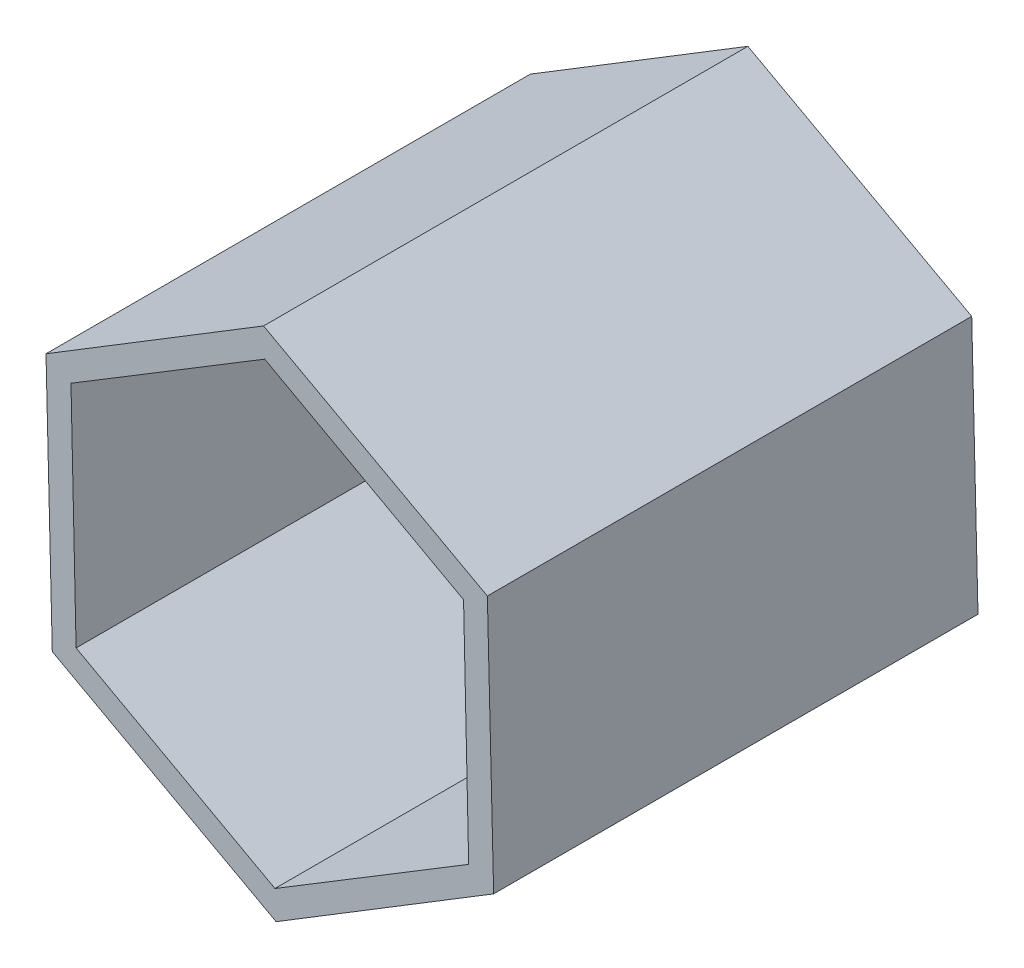
ISO-10303-21;
HEADER;
FILE_DESCRIPTION(('STEP AP214'),'2;1');
FILE_NAME('part.step','',(''),(''),'','','');
FILE_SCHEMA(('AUTOMOTIVE_DESIGN { 1 0 10303 214 1 1 1 1 }'));
ENDSEC;
DATA;
#1=APPLICATION_CONTEXT('core data for automotive mechanical design processes');
#2=APPLICATION_PROTOCOL_DEFINITION('international standard','automotive_design',2000,#1);
#3=PRODUCT_CONTEXT('',#1,'mechanical');
#4=PRODUCT('Part','Part','',(#3));
#5=PRODUCT_RELATED_PRODUCT_CATEGORY('part','',(#4));
#6=PRODUCT_DEFINITION_FORMATION('','',#4);
#7=PRODUCT_DEFINITION_CONTEXT('part definition',#1,'design');
#8=PRODUCT_DEFINITION('design','',#6,#7);
#9=PRODUCT_DEFINITION_SHAPE('','',#8);
#10=(LENGTH_UNIT() NAMED_UNIT(*) SI_UNIT(.MILLI.,.METRE.));
#11=(NAMED_UNIT(*) PLANE_ANGLE_UNIT() SI_UNIT($,.RADIAN.));
#12=(NAMED_UNIT(*) SI_UNIT($,.STERADIAN.) SOLID_ANGLE_UNIT());
#13=UNCERTAINTY_MEASURE_WITH_UNIT(LENGTH_MEASURE(1.E-05),#10,'distance_accuracy_value','');
#14=(GEOMETRIC_REPRESENTATION_CONTEXT(3) GLOBAL_UNCERTAINTY_ASSIGNED_CONTEXT((#13)) GLOBAL_UNIT_ASSIGNED_CONTEXT((#10,
#11,#12)) REPRESENTATION_CONTEXT('',''));
#15=CARTESIAN_POINT('',(0.,0.,0.));
#16=DIRECTION('',(0.,0.,1.));
#17=DIRECTION('',(1.,0.,0.));
#18=AXIS2_PLACEMENT_3D('',#15,#16,#17);
#19=CARTESIAN_POINT('',(58.6900866331029,-31.9809873450362,127.));
#20=DIRECTION('',(-0.999695721622004,-0.0246670665191707,0.));
#21=DIRECTION('',(0.0246670665191707,-0.999695721622004,0.));
#22=AXIS2_PLACEMENT_3D('',#19,#20,#21);
#23=PLANE('',#22);
#24=DIRECTION('',(-0.0246670665191707,0.999695721622004,0.));
#25=VECTOR('',#24,1.);
#26=CARTESIAN_POINT('',(58.6900866331029,-31.9809873450362,0.));
#27=LINE('',#26,#25);
#28=CARTESIAN_POINT('',(58.6900866331029,-31.9809873450362,0.));
#29=VERTEX_POINT('',#28);
#30=CARTESIAN_POINT('',(57.0413907954614,34.8366123020586,0.));
#31=VERTEX_POINT('',#30);
#32=EDGE_CURVE('E166',#29,#31,#27,.T.);
#33=ORIENTED_EDGE('',*,*,#32,.T.);
#34=DIRECTION('',(0.,0.,-1.));
#35=VECTOR('',#34,1.);
#36=CARTESIAN_POINT('',(57.0413907954614,34.8366123020586,127.));
#37=LINE('',#36,#35);
#38=CARTESIAN_POINT('',(57.0413907954614,34.8366123020586,127.));
#39=VERTEX_POINT('',#38);
#40=EDGE_CURVE('E11',#39,#31,#37,.T.);
#41=ORIENTED_EDGE('',*,*,#40,.F.);
#42=DIRECTION('',(-0.0246670665191707,0.999695721622004,0.));
#43=VECTOR('',#42,1.);
#44=CARTESIAN_POINT('',(58.6900866331029,-31.9809873450362,127.));
#45=LINE('',#44,#43);
#46=CARTESIAN_POINT('',(58.6900866331029,-31.9809873450362,127.));
#47=VERTEX_POINT('',#46);
#48=EDGE_CURVE('E174',#47,#39,#45,.T.);
#49=ORIENTED_EDGE('',*,*,#48,.F.);
#50=DIRECTION('',(0.,0.,-1.));
#51=VECTOR('',#50,1.);
#52=CARTESIAN_POINT('',(58.6900866331029,-31.9809873450362,127.));
#53=LINE('',#52,#51);
#54=EDGE_CURVE('E188',#47,#29,#53,.T.);
#55=ORIENTED_EDGE('',*,*,#54,.T.);
#56=EDGE_LOOP('',(#33,#41,#49,#55));
#57=FACE_BOUND('',#56,.T.);
#58=ADVANCED_FACE('F33',(#57),#23,.F.);
#59=CARTESIAN_POINT('',(57.0413907954614,34.8366123020586,127.));
#60=DIRECTION('',(-0.478485554568559,-0.878095424238857,0.));
#61=DIRECTION('',(0.878095424238857,-0.478485554568559,0.));
#62=AXIS2_PLACEMENT_3D('',#59,#60,#61);
#63=PLANE('',#62);
#64=DIRECTION('',(-0.878095424238857,0.478485554568559,0.));
#65=VECTOR('',#64,1.);
#66=CARTESIAN_POINT('',(57.0413907954614,34.8366123020586,0.));
#67=LINE('',#66,#65);
#68=CARTESIAN_POINT('',(-1.64869583764149,66.8175996470947,0.));
#69=VERTEX_POINT('',#68);
#70=EDGE_CURVE('E191',#31,#69,#67,.T.);
#71=ORIENTED_EDGE('',*,*,#70,.T.);
#72=DIRECTION('',(0.,0.,-1.));
#73=VECTOR('',#72,1.);
#74=CARTESIAN_POINT('',(-1.64869583764149,66.8175996470947,127.));
#75=LINE('',#74,#73);
#76=CARTESIAN_POINT('',(-1.64869583764149,66.8175996470947,127.));
#77=VERTEX_POINT('',#76);
#78=EDGE_CURVE('E40',#77,#69,#75,.T.);
#79=ORIENTED_EDGE('',*,*,#78,.F.);
#80=DIRECTION('',(-0.878095424238857,0.478485554568559,0.));
#81=VECTOR('',#80,1.);
#82=CARTESIAN_POINT('',(57.0413907954614,34.8366123020586,127.));
#83=LINE('',#82,#81);
#84=EDGE_CURVE('E177',#39,#77,#83,.T.);
#85=ORIENTED_EDGE('',*,*,#84,.F.);
#86=ORIENTED_EDGE('',*,*,#40,.T.);
#87=EDGE_LOOP('',(#71,#79,#85,#86));
#88=FACE_BOUND('',#87,.T.);
#89=ADVANCED_FACE('F236',(#88),#63,.F.);
#90=CARTESIAN_POINT('',(-1.64869583764149,66.8175996470947,127.));
#91=DIRECTION('',(0.521210167053444,-0.853428357719686,0.));
#92=DIRECTION('',(0.853428357719686,0.521210167053444,0.));
#93=AXIS2_PLACEMENT_3D('',#90,#91,#92);
#94=PLANE('',#93);
#95=DIRECTION('',(-0.853428357719686,-0.521210167053444,0.));
#96=VECTOR('',#95,1.);
#97=CARTESIAN_POINT('',(-1.64869583764149,66.8175996470947,0.));
#98=LINE('',#97,#96);
#99=CARTESIAN_POINT('',(-58.6900866331029,31.9809873450362,0.));
#100=VERTEX_POINT('',#99);
#101=EDGE_CURVE('E193',#69,#100,#98,.T.);
#102=ORIENTED_EDGE('',*,*,#101,.T.);
#103=DIRECTION('',(0.,0.,-1.));
#104=VECTOR('',#103,1.);
#105=CARTESIAN_POINT('',(-58.6900866331029,31.9809873450362,127.));
#106=LINE('',#105,#104);
#107=CARTESIAN_POINT('',(-58.6900866331029,31.9809873450362,127.));
#108=VERTEX_POINT('',#107);
#109=EDGE_CURVE('E208',#108,#100,#106,.T.);
#110=ORIENTED_EDGE('',*,*,#109,.F.);
#111=DIRECTION('',(-0.853428357719686,-0.521210167053444,0.));
#112=VECTOR('',#111,1.);
#113=CARTESIAN_POINT('',(-1.64869583764149,66.8175996470947,127.));
#114=LINE('',#113,#112);
#115=EDGE_CURVE('E180',#77,#108,#114,.T.);
#116=ORIENTED_EDGE('',*,*,#115,.F.);
#117=ORIENTED_EDGE('',*,*,#78,.T.);
#118=EDGE_LOOP('',(#102,#110,#116,#117));
#119=FACE_BOUND('',#118,.T.);
#120=ADVANCED_FACE('F215',(#119),#94,.F.);
#121=CARTESIAN_POINT('',(-58.6900866331029,31.9809873450362,127.));
#122=DIRECTION('',(0.999695721622004,0.024667066519171,0.));
#123=DIRECTION('',(-0.024667066519171,0.999695721622004,0.));
#124=AXIS2_PLACEMENT_3D('',#121,#122,#123);
#125=PLANE('',#124);
#126=DIRECTION('',(0.024667066519171,-0.999695721622004,0.));
#127=VECTOR('',#126,1.);
#128=CARTESIAN_POINT('',(-58.6900866331029,31.9809873450362,0.));
#129=LINE('',#128,#127);
#130=CARTESIAN_POINT('',(-57.0413907954614,-34.8366123020586,0.));
#131=VERTEX_POINT('',#130);
#132=EDGE_CURVE('E195',#100,#131,#129,.T.);
#133=ORIENTED_EDGE('',*,*,#132,.T.);
#134=DIRECTION('',(0.,0.,-1.));
#135=VECTOR('',#134,1.);
#136=CARTESIAN_POINT('',(-57.0413907954614,-34.8366123020586,127.));
#137=LINE('',#136,#135);
#138=CARTESIAN_POINT('',(-57.0413907954614,-34.8366123020586,127.));
#139=VERTEX_POINT('',#138);
#140=EDGE_CURVE('E205',#139,#131,#137,.T.);
#141=ORIENTED_EDGE('',*,*,#140,.F.);
#142=DIRECTION('',(0.024667066519171,-0.999695721622004,0.));
#143=VECTOR('',#142,1.);
#144=CARTESIAN_POINT('',(-58.6900866331029,31.9809873450362,127.));
#145=LINE('',#144,#143);
#146=EDGE_CURVE('E182',#108,#139,#145,.T.);
#147=ORIENTED_EDGE('',*,*,#146,.F.);
#148=ORIENTED_EDGE('',*,*,#109,.T.);
#149=EDGE_LOOP('',(#133,#141,#147,#148));
#150=FACE_BOUND('',#149,.T.);
#151=ADVANCED_FACE('F224',(#150),#125,.F.);
#152=CARTESIAN_POINT('',(-57.0413907954614,-34.8366123020586,127.));
#153=DIRECTION('',(0.478485554568559,0.878095424238857,0.));
#154=DIRECTION('',(-0.878095424238857,0.478485554568559,0.));
#155=AXIS2_PLACEMENT_3D('',#152,#153,#154);
#156=PLANE('',#155);
#157=DIRECTION('',(0.878095424238857,-0.478485554568559,0.));
#158=VECTOR('',#157,1.);
#159=CARTESIAN_POINT('',(-57.0413907954614,-34.8366123020586,0.));
#160=LINE('',#159,#158);
#161=CARTESIAN_POINT('',(1.6486958376415,-66.8175996470947,0.));
#162=VERTEX_POINT('',#161);
#163=EDGE_CURVE('E197',#131,#162,#160,.T.);
#164=ORIENTED_EDGE('',*,*,#163,.T.);
#165=DIRECTION('',(0.,0.,-1.));
#166=VECTOR('',#165,1.);
#167=CARTESIAN_POINT('',(1.6486958376415,-66.8175996470947,127.));
#168=LINE('',#167,#166);
#169=CARTESIAN_POINT('',(1.6486958376415,-66.8175996470947,127.));
#170=VERTEX_POINT('',#169);
#171=EDGE_CURVE('E202',#170,#162,#168,.T.);
#172=ORIENTED_EDGE('',*,*,#171,.F.);
#173=DIRECTION('',(0.878095424238857,-0.478485554568559,0.));
#174=VECTOR('',#173,1.);
#175=CARTESIAN_POINT('',(-57.0413907954614,-34.8366123020586,127.));
#176=LINE('',#175,#174);
#177=EDGE_CURVE('E184',#139,#170,#176,.T.);
#178=ORIENTED_EDGE('',*,*,#177,.F.);
#179=ORIENTED_EDGE('',*,*,#140,.T.);
#180=EDGE_LOOP('',(#164,#172,#178,#179));
#181=FACE_BOUND('',#180,.T.);
#182=ADVANCED_FACE('F228',(#181),#156,.F.);
#183=CARTESIAN_POINT('',(1.6486958376415,-66.8175996470947,127.));
#184=DIRECTION('',(-0.521210167053444,0.853428357719686,0.));
#185=DIRECTION('',(-0.853428357719686,-0.521210167053444,0.));
#186=AXIS2_PLACEMENT_3D('',#183,#184,#185);
#187=PLANE('',#186);
#188=DIRECTION('',(0.853428357719686,0.521210167053444,0.));
#189=VECTOR('',#188,1.);
#190=CARTESIAN_POINT('',(1.6486958376415,-66.8175996470947,0.));
#191=LINE('',#190,#189);
#192=EDGE_CURVE('E178',#162,#29,#191,.T.);
#193=ORIENTED_EDGE('',*,*,#192,.T.);
#194=ORIENTED_EDGE('',*,*,#54,.F.);
#195=DIRECTION('',(0.853428357719686,0.521210167053444,0.));
#196=VECTOR('',#195,1.);
#197=CARTESIAN_POINT('',(1.6486958376415,-66.8175996470947,127.));
#198=LINE('',#197,#196);
#199=EDGE_CURVE('E186',#170,#47,#198,.T.);
#200=ORIENTED_EDGE('',*,*,#199,.F.);
#201=ORIENTED_EDGE('',*,*,#171,.T.);
#202=EDGE_LOOP('',(#193,#194,#200,#201));
#203=FACE_BOUND('',#202,.T.);
#204=ADVANCED_FACE('F239',(#203),#187,.F.);
#205=CARTESIAN_POINT('',(0.,0.,127.));
#206=DIRECTION('',(0.,0.,1.));
#207=DIRECTION('',(1.,0.,0.));
#208=AXIS2_PLACEMENT_3D('',#205,#206,#207);
#209=PLANE('',#208);
#210=DIRECTION('',(-0.0225872488039505,0.999744875551492,0.));
#211=VECTOR('',#210,1.);
#212=CARTESIAN_POINT('',(52.1418978545714,-28.5536401700232,127.));
#213=LINE('',#212,#211);
#214=CARTESIAN_POINT('',(52.1418978545714,-28.5536401700232,127.));
#215=VERTEX_POINT('',#214);
#216=CARTESIAN_POINT('',(50.7991266850456,30.8793880585805,127.));
#217=VERTEX_POINT('',#216);
#218=EDGE_CURVE('E47',#215,#217,#213,.T.);
#219=ORIENTED_EDGE('',*,*,#218,.F.);
#220=DIRECTION('',(0.854510835128929,0.519433569041567,0.));
#221=VECTOR('',#220,1.);
#222=CARTESIAN_POINT('',(1.34277116952577,-59.4330282286038,127.));
#223=LINE('',#222,#221);
#224=CARTESIAN_POINT('',(1.34277116952577,-59.4330282286038,127.));
#225=VERTEX_POINT('',#224);
#226=EDGE_CURVE('E140',#225,#215,#223,.T.);
#227=ORIENTED_EDGE('',*,*,#226,.F.);
#228=DIRECTION('',(0.877098083932879,-0.480311306509925,0.));
#229=VECTOR('',#228,1.);
#230=CARTESIAN_POINT('',(-50.7991266850456,-30.8793880585806,127.));
#231=LINE('',#230,#229);
#232=CARTESIAN_POINT('',(-50.7991266850456,-30.8793880585806,127.));
#233=VERTEX_POINT('',#232);
#234=EDGE_CURVE('E143',#233,#225,#231,.T.);
#235=ORIENTED_EDGE('',*,*,#234,.F.);
#236=DIRECTION('',(0.0225872488039505,-0.999744875551492,0.));
#237=VECTOR('',#236,1.);
#238=CARTESIAN_POINT('',(-52.1418978545714,28.5536401700232,127.));
#239=LINE('',#238,#237);
#240=CARTESIAN_POINT('',(-52.1418978545714,28.5536401700232,127.));
#241=VERTEX_POINT('',#240);
#242=EDGE_CURVE('E159',#241,#233,#239,.T.);
#243=ORIENTED_EDGE('',*,*,#242,.F.);
#244=DIRECTION('',(-0.854510835128929,-0.519433569041567,0.));
#245=VECTOR('',#244,1.);
#246=CARTESIAN_POINT('',(-1.34277116952575,59.4330282286038,127.));
#247=LINE('',#246,#245);
#248=CARTESIAN_POINT('',(-1.34277116952575,59.4330282286038,127.));
#249=VERTEX_POINT('',#248);
#250=EDGE_CURVE('E156',#249,#241,#247,.T.);
#251=ORIENTED_EDGE('',*,*,#250,.F.);
#252=DIRECTION('',(-0.87709808393288,0.480311306509926,0.));
#253=VECTOR('',#252,1.);
#254=CARTESIAN_POINT('',(50.7991266850456,30.8793880585805,127.));
#255=LINE('',#254,#253);
#256=EDGE_CURVE('E154',#217,#249,#255,.T.);
#257=ORIENTED_EDGE('',*,*,#256,.F.);
#258=EDGE_LOOP('',(#219,#227,#235,#243,#251,#257));
#259=FACE_BOUND('',#258,.T.);
#260=ORIENTED_EDGE('',*,*,#48,.T.);
#261=ORIENTED_EDGE('',*,*,#84,.T.);
#262=ORIENTED_EDGE('',*,*,#115,.T.);
#263=ORIENTED_EDGE('',*,*,#146,.T.);
#264=ORIENTED_EDGE('',*,*,#177,.T.);
#265=ORIENTED_EDGE('',*,*,#199,.T.);
#266=EDGE_LOOP('',(#260,#261,#262,#263,#264,#265));
#267=FACE_BOUND('',#266,.T.);
#268=ADVANCED_FACE('F232',(#259,#267),#209,.T.);
#269=CARTESIAN_POINT('',(0.,0.,0.));
#270=DIRECTION('',(0.,0.,1.));
#271=DIRECTION('',(1.,0.,0.));
#272=AXIS2_PLACEMENT_3D('',#269,#270,#271);
#273=PLANE('',#272);
#274=DIRECTION('',(0.854510835128929,0.519433569041567,0.));
#275=VECTOR('',#274,1.);
#276=CARTESIAN_POINT('',(1.34277116952577,-59.4330282286038,0.));
#277=LINE('',#276,#275);
#278=CARTESIAN_POINT('',(1.34277116952577,-59.4330282286038,0.));
#279=VERTEX_POINT('',#278);
#280=CARTESIAN_POINT('',(52.1418978545714,-28.5536401700232,0.));
#281=VERTEX_POINT('',#280);
#282=EDGE_CURVE('E129',#279,#281,#277,.T.);
#283=ORIENTED_EDGE('',*,*,#282,.T.);
#284=DIRECTION('',(-0.0225872488039505,0.999744875551492,0.));
#285=VECTOR('',#284,1.);
#286=CARTESIAN_POINT('',(52.1418978545714,-28.5536401700232,0.));
#287=LINE('',#286,#285);
#288=CARTESIAN_POINT('',(50.7991266850456,30.8793880585805,0.));
#289=VERTEX_POINT('',#288);
#290=EDGE_CURVE('E123',#281,#289,#287,.T.);
#291=ORIENTED_EDGE('',*,*,#290,.T.);
#292=DIRECTION('',(-0.87709808393288,0.480311306509926,0.));
#293=VECTOR('',#292,1.);
#294=CARTESIAN_POINT('',(50.7991266850456,30.8793880585805,0.));
#295=LINE('',#294,#293);
#296=CARTESIAN_POINT('',(-1.34277116952575,59.4330282286037,0.));
#297=VERTEX_POINT('',#296);
#298=EDGE_CURVE('E132',#289,#297,#295,.T.);
#299=ORIENTED_EDGE('',*,*,#298,.T.);
#300=DIRECTION('',(-0.854510835128929,-0.519433569041567,0.));
#301=VECTOR('',#300,1.);
#302=CARTESIAN_POINT('',(-1.34277116952575,59.4330282286038,0.));
#303=LINE('',#302,#301);
#304=CARTESIAN_POINT('',(-52.1418978545714,28.5536401700232,0.));
#305=VERTEX_POINT('',#304);
#306=EDGE_CURVE('E55',#297,#305,#303,.T.);
#307=ORIENTED_EDGE('',*,*,#306,.T.);
#308=DIRECTION('',(0.0225872488039505,-0.999744875551492,0.));
#309=VECTOR('',#308,1.);
#310=CARTESIAN_POINT('',(-52.1418978545714,28.5536401700232,0.));
#311=LINE('',#310,#309);
#312=CARTESIAN_POINT('',(-50.7991266850456,-30.8793880585806,0.));
#313=VERTEX_POINT('',#312);
#314=EDGE_CURVE('E147',#305,#313,#311,.T.);
#315=ORIENTED_EDGE('',*,*,#314,.T.);
#316=DIRECTION('',(0.877098083932879,-0.480311306509925,0.));
#317=VECTOR('',#316,1.);
#318=CARTESIAN_POINT('',(-50.7991266850456,-30.8793880585806,0.));
#319=LINE('',#318,#317);
#320=EDGE_CURVE('E150',#313,#279,#319,.T.);
#321=ORIENTED_EDGE('',*,*,#320,.T.);
#322=EDGE_LOOP('',(#283,#291,#299,#307,#315,#321));
#323=FACE_BOUND('',#322,.T.);
#324=ORIENTED_EDGE('',*,*,#32,.F.);
#325=ORIENTED_EDGE('',*,*,#192,.F.);
#326=ORIENTED_EDGE('',*,*,#163,.F.);
#327=ORIENTED_EDGE('',*,*,#132,.F.);
#328=ORIENTED_EDGE('',*,*,#101,.F.);
#329=ORIENTED_EDGE('',*,*,#70,.F.);
#330=EDGE_LOOP('',(#324,#325,#326,#327,#328,#329));
#331=FACE_BOUND('',#330,.T.);
#332=ADVANCED_FACE('F136',(#323,#331),#273,.F.);
#333=CARTESIAN_POINT('',(52.1418978545714,-28.5536401700232,0.));
#334=DIRECTION('',(0.999744875551492,0.0225872488039505,0.));
#335=DIRECTION('',(-0.0225872488039505,0.999744875551492,0.));
#336=AXIS2_PLACEMENT_3D('',#333,#334,#335);
#337=PLANE('',#336);
#338=ORIENTED_EDGE('',*,*,#218,.T.);
#339=DIRECTION('',(0.,0.,1.));
#340=VECTOR('',#339,1.);
#341=CARTESIAN_POINT('',(50.7991266850456,30.8793880585805,0.));
#342=LINE('',#341,#340);
#343=EDGE_CURVE('E119',#289,#217,#342,.T.);
#344=ORIENTED_EDGE('',*,*,#343,.F.);
#345=ORIENTED_EDGE('',*,*,#290,.F.);
#346=DIRECTION('',(0.,0.,1.));
#347=VECTOR('',#346,1.);
#348=CARTESIAN_POINT('',(52.1418978545714,-28.5536401700232,0.));
#349=LINE('',#348,#347);
#350=EDGE_CURVE('E164',#281,#215,#349,.T.);
#351=ORIENTED_EDGE('',*,*,#350,.T.);
#352=EDGE_LOOP('',(#338,#344,#345,#351));
#353=FACE_BOUND('',#352,.T.);
#354=ADVANCED_FACE('F121',(#353),#337,.F.);
#355=CARTESIAN_POINT('',(1.34277116952577,-59.4330282286038,0.));
#356=DIRECTION('',(0.519433569041567,-0.854510835128929,0.));
#357=DIRECTION('',(0.854510835128929,0.519433569041567,0.));
#358=AXIS2_PLACEMENT_3D('',#355,#356,#357);
#359=PLANE('',#358);
#360=ORIENTED_EDGE('',*,*,#226,.T.);
#361=ORIENTED_EDGE('',*,*,#350,.F.);
#362=ORIENTED_EDGE('',*,*,#282,.F.);
#363=DIRECTION('',(0.,0.,1.));
#364=VECTOR('',#363,1.);
#365=CARTESIAN_POINT('',(1.34277116952577,-59.4330282286038,0.));
#366=LINE('',#365,#364);
#367=EDGE_CURVE('E167',#279,#225,#366,.T.);
#368=ORIENTED_EDGE('',*,*,#367,.T.);
#369=EDGE_LOOP('',(#360,#361,#362,#368));
#370=FACE_BOUND('',#369,.T.);
#371=ADVANCED_FACE('F294',(#370),#359,.F.);
#372=CARTESIAN_POINT('',(-50.7991266850456,-30.8793880585806,0.));
#373=DIRECTION('',(-0.480311306509925,-0.877098083932879,0.));
#374=DIRECTION('',(0.87709808393288,-0.480311306509925,0.));
#375=AXIS2_PLACEMENT_3D('',#372,#373,#374);
#376=PLANE('',#375);
#377=ORIENTED_EDGE('',*,*,#234,.T.);
#378=ORIENTED_EDGE('',*,*,#367,.F.);
#379=ORIENTED_EDGE('',*,*,#320,.F.);
#380=DIRECTION('',(0.,0.,1.));
#381=VECTOR('',#380,1.);
#382=CARTESIAN_POINT('',(-50.7991266850456,-30.8793880585806,0.));
#383=LINE('',#382,#381);
#384=EDGE_CURVE('E169',#313,#233,#383,.T.);
#385=ORIENTED_EDGE('',*,*,#384,.T.);
#386=EDGE_LOOP('',(#377,#378,#379,#385));
#387=FACE_BOUND('',#386,.T.);
#388=ADVANCED_FACE('F303',(#387),#376,.F.);
#389=CARTESIAN_POINT('',(-52.1418978545714,28.5536401700232,0.));
#390=DIRECTION('',(-0.999744875551492,-0.0225872488039505,0.));
#391=DIRECTION('',(0.0225872488039505,-0.999744875551492,0.));
#392=AXIS2_PLACEMENT_3D('',#389,#390,#391);
#393=PLANE('',#392);
#394=ORIENTED_EDGE('',*,*,#242,.T.);
#395=ORIENTED_EDGE('',*,*,#384,.F.);
#396=ORIENTED_EDGE('',*,*,#314,.F.);
#397=DIRECTION('',(0.,0.,1.));
#398=VECTOR('',#397,1.);
#399=CARTESIAN_POINT('',(-52.1418978545714,28.5536401700232,0.));
#400=LINE('',#399,#398);
#401=EDGE_CURVE('E171',#305,#241,#400,.T.);
#402=ORIENTED_EDGE('',*,*,#401,.T.);
#403=EDGE_LOOP('',(#394,#395,#396,#402));
#404=FACE_BOUND('',#403,.T.);
#405=ADVANCED_FACE('F313',(#404),#393,.F.);
#406=CARTESIAN_POINT('',(-1.34277116952575,59.4330282286038,0.));
#407=DIRECTION('',(-0.519433569041567,0.854510835128929,0.));
#408=DIRECTION('',(-0.854510835128929,-0.519433569041567,0.));
#409=AXIS2_PLACEMENT_3D('',#406,#407,#408);
#410=PLANE('',#409);
#411=ORIENTED_EDGE('',*,*,#250,.T.);
#412=ORIENTED_EDGE('',*,*,#401,.F.);
#413=ORIENTED_EDGE('',*,*,#306,.F.);
#414=DIRECTION('',(0.,0.,1.));
#415=VECTOR('',#414,1.);
#416=CARTESIAN_POINT('',(-1.34277116952575,59.4330282286038,0.));
#417=LINE('',#416,#415);
#418=EDGE_CURVE('E128',#297,#249,#417,.T.);
#419=ORIENTED_EDGE('',*,*,#418,.T.);
#420=EDGE_LOOP('',(#411,#412,#413,#419));
#421=FACE_BOUND('',#420,.T.);
#422=ADVANCED_FACE('F323',(#421),#410,.F.);
#423=CARTESIAN_POINT('',(50.7991266850456,30.8793880585805,0.));
#424=DIRECTION('',(0.480311306509925,0.877098083932879,0.));
#425=DIRECTION('',(-0.877098083932879,0.480311306509925,0.));
#426=AXIS2_PLACEMENT_3D('',#423,#424,#425);
#427=PLANE('',#426);
#428=ORIENTED_EDGE('',*,*,#256,.T.);
#429=ORIENTED_EDGE('',*,*,#418,.F.);
#430=ORIENTED_EDGE('',*,*,#298,.F.);
#431=ORIENTED_EDGE('',*,*,#343,.T.);
#432=EDGE_LOOP('',(#428,#429,#430,#431));
#433=FACE_BOUND('',#432,.T.);
#434=ADVANCED_FACE('F133',(#433),#427,.F.);
#435=CLOSED_SHELL('',(#58,#89,#120,#151,#182,#204,#268,#332,#354,#371,#388,#405,#422,#434));
#436=MANIFOLD_SOLID_BREP('B2',#435);
#437=ADVANCED_BREP_SHAPE_REPRESENTATION('',(#18,#436),#14);
#438=SHAPE_DEFINITION_REPRESENTATION(#9,#437);
ENDSEC;
END-ISO-10303-21;
